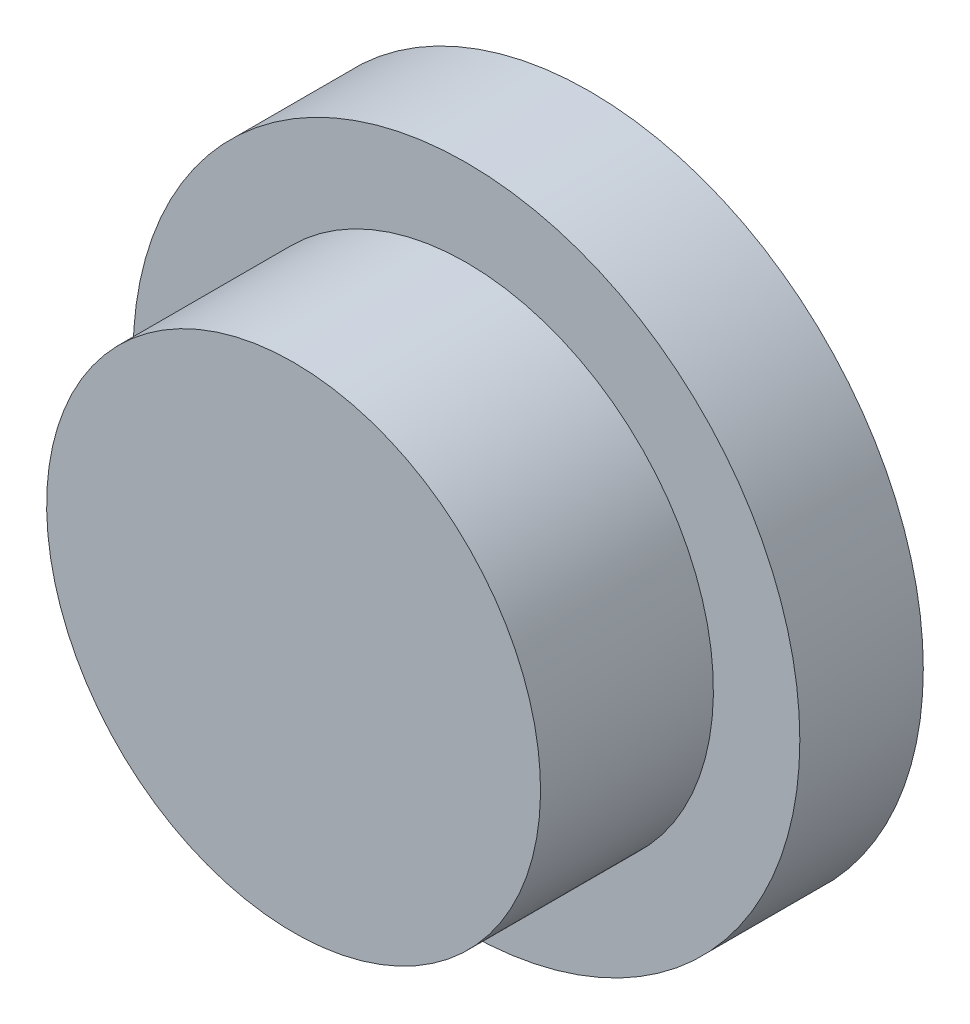
ISO-10303-21;
HEADER;
FILE_DESCRIPTION(('STEP AP214'),'2;1');
FILE_NAME('part.step','',(''),(''),'','','');
FILE_SCHEMA(('AUTOMOTIVE_DESIGN { 1 0 10303 214 1 1 1 1 }'));
ENDSEC;
DATA;
#1=APPLICATION_CONTEXT('core data for automotive mechanical design processes');
#2=APPLICATION_PROTOCOL_DEFINITION('international standard','automotive_design',2000,#1);
#3=PRODUCT_CONTEXT('',#1,'mechanical');
#4=PRODUCT('Part','Part','',(#3));
#5=PRODUCT_RELATED_PRODUCT_CATEGORY('part','',(#4));
#6=PRODUCT_DEFINITION_FORMATION('','',#4);
#7=PRODUCT_DEFINITION_CONTEXT('part definition',#1,'design');
#8=PRODUCT_DEFINITION('design','',#6,#7);
#9=PRODUCT_DEFINITION_SHAPE('','',#8);
#10=(LENGTH_UNIT() NAMED_UNIT(*) SI_UNIT(.MILLI.,.METRE.));
#11=(NAMED_UNIT(*) PLANE_ANGLE_UNIT() SI_UNIT($,.RADIAN.));
#12=(NAMED_UNIT(*) SI_UNIT($,.STERADIAN.) SOLID_ANGLE_UNIT());
#13=UNCERTAINTY_MEASURE_WITH_UNIT(LENGTH_MEASURE(1.E-05),#10,'distance_accuracy_value','');
#14=(GEOMETRIC_REPRESENTATION_CONTEXT(3) GLOBAL_UNCERTAINTY_ASSIGNED_CONTEXT((#13)) GLOBAL_UNIT_ASSIGNED_CONTEXT((#10,
#11,#12)) REPRESENTATION_CONTEXT('',''));
#15=CARTESIAN_POINT('',(0.,0.,0.));
#16=DIRECTION('',(0.,0.,1.));
#17=DIRECTION('',(1.,0.,0.));
#18=AXIS2_PLACEMENT_3D('',#15,#16,#17);
#19=CARTESIAN_POINT('',(0.,0.,-1.2));
#20=DIRECTION('',(0.,0.,-1.));
#21=DIRECTION('',(0.,1.,0.));
#22=AXIS2_PLACEMENT_3D('',#19,#20,#21);
#23=CONICAL_SURFACE('',#22,0.7,0.785398163397);
#24=CARTESIAN_POINT('',(0.,0.,-1.2));
#25=DIRECTION('',(0.,0.,-1.));
#26=DIRECTION('',(0.,1.,0.));
#27=AXIS2_PLACEMENT_3D('',#24,#25,#26);
#28=CIRCLE('',#27,0.7);
#29=CARTESIAN_POINT('',(0.,0.7,-1.2));
#30=VERTEX_POINT('',#29);
#31=EDGE_CURVE('E20',#30,#30,#28,.T.);
#32=ORIENTED_EDGE('',*,*,#31,.T.);
#33=DIRECTION('',(0.,-0.707106781186048,0.707106781187048));
#34=VECTOR('',#33,1.);
#35=CARTESIAN_POINT('',(0.,0.7,-1.2));
#36=LINE('',#35,#34);
#37=CARTESIAN_POINT('',(0.,0.,-0.499999999999));
#38=VERTEX_POINT('',#37);
#39=EDGE_CURVE('E11',#30,#38,#36,.T.);
#40=ORIENTED_EDGE('',*,*,#39,.T.);
#41=ORIENTED_EDGE('',*,*,#39,.F.);
#42=EDGE_LOOP('',(#32,#40,#41));
#43=FACE_BOUND('',#42,.T.);
#44=ADVANCED_FACE('F17',(#43),#23,.F.);
#45=CARTESIAN_POINT('',(0.,0.,-1.2));
#46=DIRECTION('',(0.,0.,1.));
#47=DIRECTION('',(1.,0.,0.));
#48=AXIS2_PLACEMENT_3D('',#45,#46,#47);
#49=PLANE('',#48);
#50=ORIENTED_EDGE('',*,*,#31,.F.);
#51=EDGE_LOOP('',(#50));
#52=FACE_BOUND('',#51,.T.);
#53=CARTESIAN_POINT('',(0.,0.,-1.2));
#54=DIRECTION('',(0.,0.,-1.));
#55=DIRECTION('',(0.,1.,0.));
#56=AXIS2_PLACEMENT_3D('',#53,#54,#55);
#57=CIRCLE('',#56,1.35);
#58=CARTESIAN_POINT('',(0.,1.35,-1.2));
#59=VERTEX_POINT('',#58);
#60=EDGE_CURVE('E63',#59,#59,#57,.T.);
#61=ORIENTED_EDGE('',*,*,#60,.T.);
#62=EDGE_LOOP('',(#61));
#63=FACE_BOUND('',#62,.T.);
#64=ADVANCED_FACE('F97',(#52,#63),#49,.F.);
#65=CARTESIAN_POINT('',(0.,0.,-0.7));
#66=DIRECTION('',(0.,0.,-1.));
#67=DIRECTION('',(0.,1.,0.));
#68=AXIS2_PLACEMENT_3D('',#65,#66,#67);
#69=CYLINDRICAL_SURFACE('',#68,1.35);
#70=CARTESIAN_POINT('',(0.,0.,-0.7));
#71=DIRECTION('',(0.,0.,-1.));
#72=DIRECTION('',(0.,1.,0.));
#73=AXIS2_PLACEMENT_3D('',#70,#71,#72);
#74=CIRCLE('',#73,1.35);
#75=CARTESIAN_POINT('',(0.,1.35,-0.7));
#76=VERTEX_POINT('',#75);
#77=EDGE_CURVE('E62',#76,#76,#74,.T.);
#78=ORIENTED_EDGE('',*,*,#77,.T.);
#79=DIRECTION('',(0.,0.,-1.));
#80=VECTOR('',#79,1.);
#81=CARTESIAN_POINT('',(0.,1.35,-0.7));
#82=LINE('',#81,#80);
#83=EDGE_CURVE('E59',#76,#59,#82,.T.);
#84=ORIENTED_EDGE('',*,*,#83,.T.);
#85=ORIENTED_EDGE('',*,*,#60,.F.);
#86=ORIENTED_EDGE('',*,*,#83,.F.);
#87=EDGE_LOOP('',(#78,#84,#85,#86));
#88=FACE_BOUND('',#87,.T.);
#89=ADVANCED_FACE('F60',(#88),#69,.T.);
#90=CARTESIAN_POINT('',(0.,0.,-0.7));
#91=DIRECTION('',(0.,0.,-1.));
#92=DIRECTION('',(0.,-1.,0.));
#93=AXIS2_PLACEMENT_3D('',#90,#91,#92);
#94=PLANE('',#93);
#95=ORIENTED_EDGE('',*,*,#77,.F.);
#96=EDGE_LOOP('',(#95));
#97=FACE_BOUND('',#96,.T.);
#98=CARTESIAN_POINT('',(0.,0.,-0.7));
#99=DIRECTION('',(0.,0.,-1.));
#100=DIRECTION('',(0.,1.,0.));
#101=AXIS2_PLACEMENT_3D('',#98,#99,#100);
#102=CIRCLE('',#101,1.);
#103=CARTESIAN_POINT('',(0.,1.,-0.7));
#104=VERTEX_POINT('',#103);
#105=EDGE_CURVE('E69',#104,#104,#102,.T.);
#106=ORIENTED_EDGE('',*,*,#105,.T.);
#107=EDGE_LOOP('',(#106));
#108=FACE_BOUND('',#107,.T.);
#109=ADVANCED_FACE('F94',(#97,#108),#94,.F.);
#110=CARTESIAN_POINT('',(0.,0.,0.));
#111=DIRECTION('',(0.,0.,-1.));
#112=DIRECTION('',(0.,1.,0.));
#113=AXIS2_PLACEMENT_3D('',#110,#111,#112);
#114=CYLINDRICAL_SURFACE('',#113,1.);
#115=CARTESIAN_POINT('',(0.,0.,0.));
#116=DIRECTION('',(0.,0.,-1.));
#117=DIRECTION('',(0.,1.,0.));
#118=AXIS2_PLACEMENT_3D('',#115,#116,#117);
#119=CIRCLE('',#118,1.);
#120=CARTESIAN_POINT('',(0.,1.,0.));
#121=VERTEX_POINT('',#120);
#122=EDGE_CURVE('E78',#121,#121,#119,.T.);
#123=ORIENTED_EDGE('',*,*,#122,.T.);
#124=DIRECTION('',(0.,0.,-1.));
#125=VECTOR('',#124,1.);
#126=CARTESIAN_POINT('',(0.,1.,0.));
#127=LINE('',#126,#125);
#128=EDGE_CURVE('E74',#121,#104,#127,.T.);
#129=ORIENTED_EDGE('',*,*,#128,.T.);
#130=ORIENTED_EDGE('',*,*,#105,.F.);
#131=ORIENTED_EDGE('',*,*,#128,.F.);
#132=EDGE_LOOP('',(#123,#129,#130,#131));
#133=FACE_BOUND('',#132,.T.);
#134=ADVANCED_FACE('F84',(#133),#114,.T.);
#135=CARTESIAN_POINT('',(0.,0.,0.));
#136=DIRECTION('',(0.,0.,-1.));
#137=DIRECTION('',(0.,-1.,0.));
#138=AXIS2_PLACEMENT_3D('',#135,#136,#137);
#139=PLANE('',#138);
#140=ORIENTED_EDGE('',*,*,#122,.F.);
#141=EDGE_LOOP('',(#140));
#142=FACE_BOUND('',#141,.T.);
#143=ADVANCED_FACE('F87',(#142),#139,.F.);
#144=CLOSED_SHELL('',(#44,#64,#89,#109,#134,#143));
#145=MANIFOLD_SOLID_BREP('B1',#144);
#146=ADVANCED_BREP_SHAPE_REPRESENTATION('',(#18,#145),#14);
#147=SHAPE_DEFINITION_REPRESENTATION(#9,#146);
ENDSEC;
END-ISO-10303-21;
